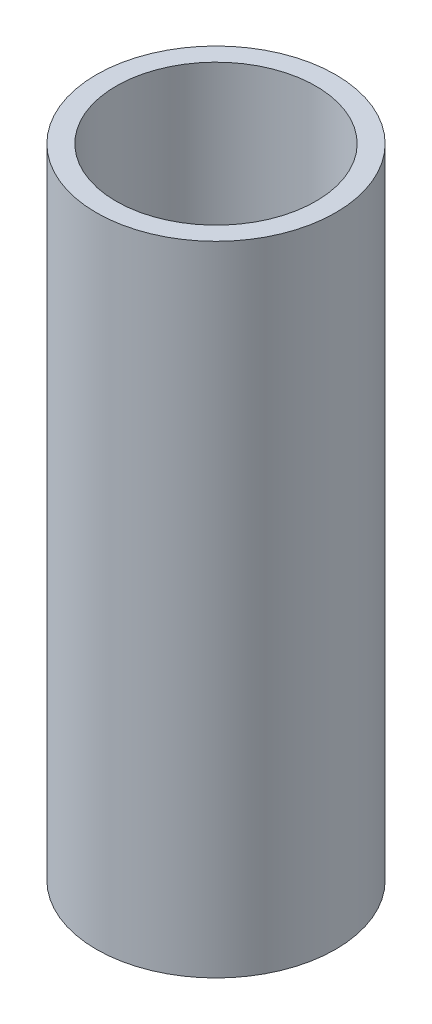
ISO-10303-21;
HEADER;
FILE_DESCRIPTION(('STEP AP214'),'2;1');
FILE_NAME('part.step','',(''),(''),'','','');
FILE_SCHEMA(('AUTOMOTIVE_DESIGN { 1 0 10303 214 1 1 1 1 }'));
ENDSEC;
DATA;
#1=APPLICATION_CONTEXT('core data for automotive mechanical design processes');
#2=APPLICATION_PROTOCOL_DEFINITION('international standard','automotive_design',2000,#1);
#3=PRODUCT_CONTEXT('',#1,'mechanical');
#4=PRODUCT('Part','Part','',(#3));
#5=PRODUCT_RELATED_PRODUCT_CATEGORY('part','',(#4));
#6=PRODUCT_DEFINITION_FORMATION('','',#4);
#7=PRODUCT_DEFINITION_CONTEXT('part definition',#1,'design');
#8=PRODUCT_DEFINITION('design','',#6,#7);
#9=PRODUCT_DEFINITION_SHAPE('','',#8);
#10=(LENGTH_UNIT() NAMED_UNIT(*) SI_UNIT(.MILLI.,.METRE.));
#11=(NAMED_UNIT(*) PLANE_ANGLE_UNIT() SI_UNIT($,.RADIAN.));
#12=(NAMED_UNIT(*) SI_UNIT($,.STERADIAN.) SOLID_ANGLE_UNIT());
#13=UNCERTAINTY_MEASURE_WITH_UNIT(LENGTH_MEASURE(1.E-05),#10,'distance_accuracy_value','');
#14=(GEOMETRIC_REPRESENTATION_CONTEXT(3) GLOBAL_UNCERTAINTY_ASSIGNED_CONTEXT((#13)) GLOBAL_UNIT_ASSIGNED_CONTEXT((#10,
#11,#12)) REPRESENTATION_CONTEXT('',''));
#15=CARTESIAN_POINT('',(0.,0.,0.));
#16=DIRECTION('',(0.,0.,1.));
#17=DIRECTION('',(1.,0.,0.));
#18=AXIS2_PLACEMENT_3D('',#15,#16,#17);
#19=CARTESIAN_POINT('',(0.,50.8,0.));
#20=DIRECTION('',(0.,1.,0.));
#21=DIRECTION('',(0.,0.,1.));
#22=AXIS2_PLACEMENT_3D('',#19,#20,#21);
#23=PLANE('',#22);
#24=CARTESIAN_POINT('',(0.,50.8,0.));
#25=DIRECTION('',(0.,1.,0.));
#26=DIRECTION('',(0.,0.,1.));
#27=AXIS2_PLACEMENT_3D('',#24,#25,#26);
#28=CIRCLE('',#27,9.525);
#29=CARTESIAN_POINT('',(0.,50.8,9.525));
#30=VERTEX_POINT('',#29);
#31=EDGE_CURVE('E10',#30,#30,#28,.T.);
#32=ORIENTED_EDGE('',*,*,#31,.T.);
#33=EDGE_LOOP('',(#32));
#34=FACE_BOUND('',#33,.T.);
#35=CARTESIAN_POINT('',(0.,50.8,0.));
#36=DIRECTION('',(0.,1.,0.));
#37=DIRECTION('',(0.,0.,1.));
#38=AXIS2_PLACEMENT_3D('',#35,#36,#37);
#39=CIRCLE('',#38,7.9502);
#40=CARTESIAN_POINT('',(0.,50.8,7.9502));
#41=VERTEX_POINT('',#40);
#42=EDGE_CURVE('E41',#41,#41,#39,.T.);
#43=ORIENTED_EDGE('',*,*,#42,.F.);
#44=EDGE_LOOP('',(#43));
#45=FACE_BOUND('',#44,.T.);
#46=ADVANCED_FACE('F30',(#34,#45),#23,.T.);
#47=CARTESIAN_POINT('',(0.,0.,0.));
#48=DIRECTION('',(0.,1.,0.));
#49=DIRECTION('',(0.,0.,1.));
#50=AXIS2_PLACEMENT_3D('',#47,#48,#49);
#51=PLANE('',#50);
#52=CARTESIAN_POINT('',(0.,0.,0.));
#53=DIRECTION('',(0.,1.,0.));
#54=DIRECTION('',(0.,0.,1.));
#55=AXIS2_PLACEMENT_3D('',#52,#53,#54);
#56=CIRCLE('',#55,9.525);
#57=CARTESIAN_POINT('',(0.,0.,9.525));
#58=VERTEX_POINT('',#57);
#59=EDGE_CURVE('E34',#58,#58,#56,.T.);
#60=ORIENTED_EDGE('',*,*,#59,.F.);
#61=EDGE_LOOP('',(#60));
#62=FACE_BOUND('',#61,.T.);
#63=CARTESIAN_POINT('',(0.,0.,0.));
#64=DIRECTION('',(0.,1.,0.));
#65=DIRECTION('',(0.,0.,1.));
#66=AXIS2_PLACEMENT_3D('',#63,#64,#65);
#67=CIRCLE('',#66,7.9502);
#68=CARTESIAN_POINT('',(0.,0.,7.9502));
#69=VERTEX_POINT('',#68);
#70=EDGE_CURVE('E43',#69,#69,#67,.T.);
#71=ORIENTED_EDGE('',*,*,#70,.T.);
#72=EDGE_LOOP('',(#71));
#73=FACE_BOUND('',#72,.T.);
#74=ADVANCED_FACE('F53',(#62,#73),#51,.F.);
#75=CARTESIAN_POINT('',(0.,50.8,0.));
#76=DIRECTION('',(0.,-1.,0.));
#77=DIRECTION('',(0.,0.,-1.));
#78=AXIS2_PLACEMENT_3D('',#75,#76,#77);
#79=CYLINDRICAL_SURFACE('',#78,9.525);
#80=ORIENTED_EDGE('',*,*,#31,.F.);
#81=EDGE_LOOP('',(#80));
#82=FACE_BOUND('',#81,.T.);
#83=ORIENTED_EDGE('',*,*,#59,.T.);
#84=EDGE_LOOP('',(#83));
#85=FACE_BOUND('',#84,.T.);
#86=ADVANCED_FACE('F32',(#82,#85),#79,.T.);
#87=CARTESIAN_POINT('',(0.,50.8,0.));
#88=DIRECTION('',(0.,-1.,0.));
#89=DIRECTION('',(0.,0.,-1.));
#90=AXIS2_PLACEMENT_3D('',#87,#88,#89);
#91=CYLINDRICAL_SURFACE('',#90,7.9502);
#92=ORIENTED_EDGE('',*,*,#42,.T.);
#93=EDGE_LOOP('',(#92));
#94=FACE_BOUND('',#93,.T.);
#95=ORIENTED_EDGE('',*,*,#70,.F.);
#96=EDGE_LOOP('',(#95));
#97=FACE_BOUND('',#96,.T.);
#98=ADVANCED_FACE('F49',(#94,#97),#91,.F.);
#99=CLOSED_SHELL('',(#46,#74,#86,#98));
#100=MANIFOLD_SOLID_BREP('B2',#99);
#101=ADVANCED_BREP_SHAPE_REPRESENTATION('',(#18,#100),#14);
#102=SHAPE_DEFINITION_REPRESENTATION(#9,#101);
ENDSEC;
END-ISO-10303-21;
